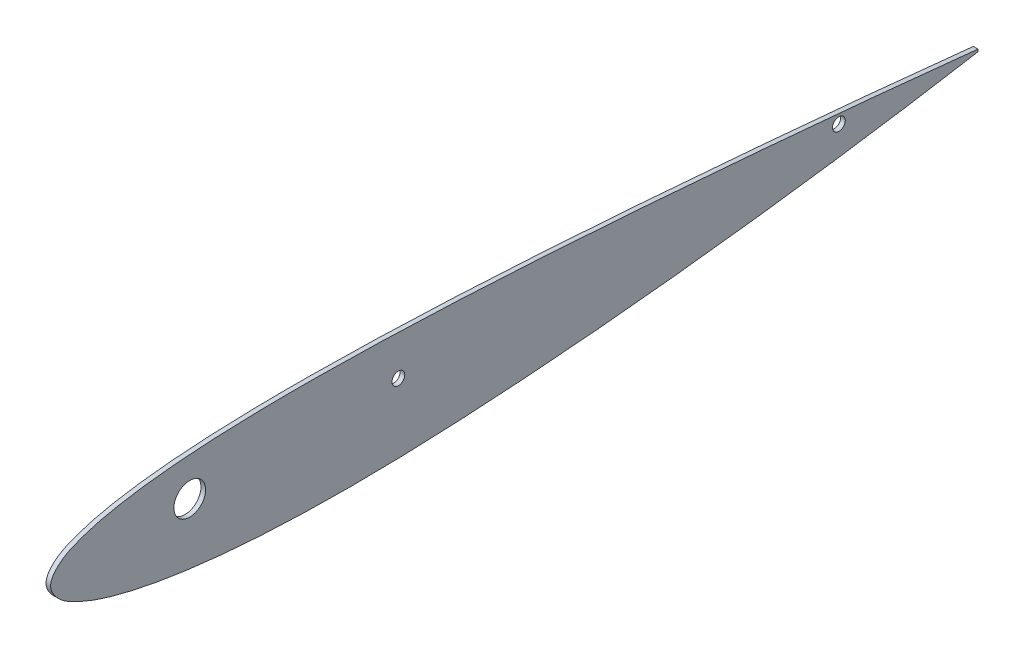
ISO-10303-21;
HEADER;
FILE_DESCRIPTION(('STEP AP214'),'2;1');
FILE_NAME('part.step','',(''),(''),'','','');
FILE_SCHEMA(('AUTOMOTIVE_DESIGN { 1 0 10303 214 1 1 1 1 }'));
ENDSEC;
DATA;
#1=APPLICATION_CONTEXT('core data for automotive mechanical design processes');
#2=APPLICATION_PROTOCOL_DEFINITION('international standard','automotive_design',2000,#1);
#3=PRODUCT_CONTEXT('',#1,'mechanical');
#4=PRODUCT('Part','Part','',(#3));
#5=PRODUCT_RELATED_PRODUCT_CATEGORY('part','',(#4));
#6=PRODUCT_DEFINITION_FORMATION('','',#4);
#7=PRODUCT_DEFINITION_CONTEXT('part definition',#1,'design');
#8=PRODUCT_DEFINITION('design','',#6,#7);
#9=PRODUCT_DEFINITION_SHAPE('','',#8);
#10=(LENGTH_UNIT() NAMED_UNIT(*) SI_UNIT(.MILLI.,.METRE.));
#11=(NAMED_UNIT(*) PLANE_ANGLE_UNIT() SI_UNIT($,.RADIAN.));
#12=(NAMED_UNIT(*) SI_UNIT($,.STERADIAN.) SOLID_ANGLE_UNIT());
#13=UNCERTAINTY_MEASURE_WITH_UNIT(LENGTH_MEASURE(1.E-05),#10,'distance_accuracy_value','');
#14=(GEOMETRIC_REPRESENTATION_CONTEXT(3) GLOBAL_UNCERTAINTY_ASSIGNED_CONTEXT((#13)) GLOBAL_UNIT_ASSIGNED_CONTEXT((#10,
#11,#12)) REPRESENTATION_CONTEXT('',''));
#15=CARTESIAN_POINT('',(0.,0.,0.));
#16=DIRECTION('',(0.,0.,1.));
#17=DIRECTION('',(1.,0.,0.));
#18=AXIS2_PLACEMENT_3D('',#15,#16,#17);
#19=CARTESIAN_POINT('',(2.,0.503992174042304,-400.000313171614));
#20=CARTESIAN_POINT('',(2.,1.20827340100886,-393.301544953931));
#21=CARTESIAN_POINT('',(2.,2.61509826056135,-379.920535640924));
#22=CARTESIAN_POINT('',(2.,5.26204092908528,-353.182419920954));
#23=CARTESIAN_POINT('',(2.,8.36048497007254,-319.807747147461));
#24=CARTESIAN_POINT('',(2.,11.7769418106569,-279.795689887196));
#25=CARTESIAN_POINT('',(2.,14.8714349090721,-239.83985117999));
#26=CARTESIAN_POINT('',(2.,17.5162944706218,-199.92592897574));
#27=CARTESIAN_POINT('',(2.,19.4977105026132,-160.093873002914));
#28=CARTESIAN_POINT('',(2.,20.4474276713772,-126.937018205107));
#29=CARTESIAN_POINT('',(2.,20.583142651895,-100.454521437832));
#30=CARTESIAN_POINT('',(2.,20.244422573222,-80.5683851009151));
#31=CARTESIAN_POINT('',(2.,19.2859043746572,-60.6319168965701));
#32=CARTESIAN_POINT('',(2.,17.7491591057004,-43.9855394702566));
#33=CARTESIAN_POINT('',(2.,15.7357427223296,-30.6260870670138));
#34=CARTESIAN_POINT('',(2.,13.6600237212905,-20.4971255760462));
#35=CARTESIAN_POINT('',(2.,10.940166720717,-11.8821326359626));
#36=CARTESIAN_POINT('',(2.,7.47483493208009,-4.38492530782633));
#37=CARTESIAN_POINT('',(2.,0.371292257930978,2.44601692576104));
#38=CARTESIAN_POINT('',(2.,-7.40123528082568,-3.65032236212266));
#39=CARTESIAN_POINT('',(2.,-11.5552530344191,-10.8325552843253));
#40=CARTESIAN_POINT('',(2.,-15.0619479719034,-19.2304132571483));
#41=CARTESIAN_POINT('',(2.,-18.0006234573957,-29.2385612271778));
#42=CARTESIAN_POINT('',(2.,-21.0820421812687,-42.5473689613135));
#43=CARTESIAN_POINT('',(2.,-23.769599097026,-59.2658971689619));
#44=CARTESIAN_POINT('',(2.,-25.8915490900184,-79.3907562963511));
#45=CARTESIAN_POINT('',(2.,-27.1185073486625,-99.5342061357415));
#46=CARTESIAN_POINT('',(2.,-27.8742360043675,-126.401333061515));
#47=CARTESIAN_POINT('',(2.,-27.3203250964933,-159.954759758316));
#48=CARTESIAN_POINT('',(2.,-25.118222975405,-200.131199498338));
#49=CARTESIAN_POINT('',(2.,-21.8612515921795,-240.218827833143));
#50=CARTESIAN_POINT('',(2.,-17.7008263072649,-280.261192131311));
#51=CARTESIAN_POINT('',(2.,-12.7868544707698,-320.255557769241));
#52=CARTESIAN_POINT('',(2.,-8.05648261964678,-353.526390030437));
#53=CARTESIAN_POINT('',(2.,-3.89731009838293,-380.103644239369));
#54=CARTESIAN_POINT('',(2.,-1.63499916551679,-393.368253000911));
#55=CARTESIAN_POINT('',(2.,-0.503992174042304,-399.999686828386));
#56=B_SPLINE_CURVE_WITH_KNOTS('',3,(#19,#20,#21,#22,#23,#24,#25,#26,#27,#28,#29,#30,#31,#32,#33,
#34,#35,#36,#37,#38,#39,#40,#41,#42,#43,#44,#45,#46,#47,#48,#49,#50,#51,#52,#53,#54,#55),
.UNSPECIFIED.,.F.,.F.,(4,1,1,1,1,1,1,1,1,1,1,1,1,1,1,1,1,1,1,1,1,1,1,1,1,1,1,1,1,1,1,1,1,1,4),
(0.,0.0247898444409783,0.049518527668585,0.0988869468263506,0.148148302407342,0.19731261260843,
0.246378146970664,0.295363956929404,0.34408374332352,0.368442721404916,0.392825641810401,
0.41727490319434,0.441884458853984,0.454325923101425,0.466947515660677,0.480022900195665,
0.487092053261674,0.498227884101779,0.509373674616872,0.516476673346114,0.529639133387933,
0.542377969647895,0.5549439711343,0.579861194114865,0.604653843655577,0.629394084082987,
0.654115914552988,0.703559499032186,0.752843021958462,0.802183907321177,0.851568359011207,
0.900997535580195,0.950476794201679,0.975241647297708,1.),.UNSPECIFIED.);
#57=DIRECTION('',(-1.,0.,0.));
#58=VECTOR('',#57,1.);
#59=SURFACE_OF_LINEAR_EXTRUSION('',#56,#58);
#60=CARTESIAN_POINT('',(0.,0.503992174042304,-400.000313171614));
#61=CARTESIAN_POINT('',(0.,1.20827340100886,-393.301544953931));
#62=CARTESIAN_POINT('',(0.,2.61509826056135,-379.920535640924));
#63=CARTESIAN_POINT('',(0.,5.26204092908528,-353.182419920954));
#64=CARTESIAN_POINT('',(0.,8.36048497007254,-319.807747147461));
#65=CARTESIAN_POINT('',(0.,11.7769418106569,-279.795689887196));
#66=CARTESIAN_POINT('',(0.,14.8714349090721,-239.83985117999));
#67=CARTESIAN_POINT('',(0.,17.5162944706218,-199.92592897574));
#68=CARTESIAN_POINT('',(0.,19.4977105026132,-160.093873002914));
#69=CARTESIAN_POINT('',(0.,20.4474276713772,-126.937018205107));
#70=CARTESIAN_POINT('',(0.,20.583142651895,-100.454521437832));
#71=CARTESIAN_POINT('',(0.,20.244422573222,-80.5683851009151));
#72=CARTESIAN_POINT('',(0.,19.2859043746572,-60.6319168965701));
#73=CARTESIAN_POINT('',(0.,17.7491591057004,-43.9855394702566));
#74=CARTESIAN_POINT('',(0.,15.7357427223296,-30.6260870670138));
#75=CARTESIAN_POINT('',(0.,13.6600237212905,-20.4971255760462));
#76=CARTESIAN_POINT('',(0.,10.940166720717,-11.8821326359626));
#77=CARTESIAN_POINT('',(0.,7.47483493208009,-4.38492530782633));
#78=CARTESIAN_POINT('',(0.,0.371292257930978,2.44601692576104));
#79=CARTESIAN_POINT('',(0.,-7.40123528082568,-3.65032236212266));
#80=CARTESIAN_POINT('',(0.,-11.5552530344191,-10.8325552843253));
#81=CARTESIAN_POINT('',(0.,-15.0619479719034,-19.2304132571483));
#82=CARTESIAN_POINT('',(0.,-18.0006234573957,-29.2385612271778));
#83=CARTESIAN_POINT('',(0.,-21.0820421812687,-42.5473689613135));
#84=CARTESIAN_POINT('',(0.,-23.769599097026,-59.2658971689619));
#85=CARTESIAN_POINT('',(0.,-25.8915490900184,-79.3907562963511));
#86=CARTESIAN_POINT('',(0.,-27.1185073486625,-99.5342061357415));
#87=CARTESIAN_POINT('',(0.,-27.8742360043675,-126.401333061515));
#88=CARTESIAN_POINT('',(0.,-27.3203250964933,-159.954759758316));
#89=CARTESIAN_POINT('',(0.,-25.118222975405,-200.131199498338));
#90=CARTESIAN_POINT('',(0.,-21.8612515921795,-240.218827833143));
#91=CARTESIAN_POINT('',(0.,-17.7008263072649,-280.261192131311));
#92=CARTESIAN_POINT('',(0.,-12.7868544707698,-320.255557769241));
#93=CARTESIAN_POINT('',(0.,-8.05648261964678,-353.526390030437));
#94=CARTESIAN_POINT('',(0.,-3.89731009838293,-380.103644239369));
#95=CARTESIAN_POINT('',(0.,-1.63499916551679,-393.368253000911));
#96=CARTESIAN_POINT('',(0.,-0.503992174042304,-399.999686828386));
#97=B_SPLINE_CURVE_WITH_KNOTS('',3,(#60,#61,#62,#63,#64,#65,#66,#67,#68,#69,#70,#71,#72,#73,#74,
#75,#76,#77,#78,#79,#80,#81,#82,#83,#84,#85,#86,#87,#88,#89,#90,#91,#92,#93,#94,#95,#96),
.UNSPECIFIED.,.F.,.F.,(4,1,1,1,1,1,1,1,1,1,1,1,1,1,1,1,1,1,1,1,1,1,1,1,1,1,1,1,1,1,1,1,1,1,4),
(0.,0.0247898444409783,0.049518527668585,0.0988869468263506,0.148148302407342,0.19731261260843,
0.246378146970664,0.295363956929404,0.34408374332352,0.368442721404916,0.392825641810401,
0.41727490319434,0.441884458853984,0.454325923101425,0.466947515660677,0.480022900195665,
0.487092053261674,0.498227884101779,0.509373674616872,0.516476673346114,0.529639133387933,
0.542377969647895,0.5549439711343,0.579861194114865,0.604653843655577,0.629394084082987,
0.654115914552988,0.703559499032186,0.752843021958462,0.802183907321177,0.851568359011207,
0.900997535580195,0.950476794201679,0.975241647297708,1.),.UNSPECIFIED.);
#98=CARTESIAN_POINT('',(0.,0.503992174042304,-400.000313171614));
#99=VERTEX_POINT('',#98);
#100=CARTESIAN_POINT('',(0.,-0.503992174042304,-399.999686828386));
#101=VERTEX_POINT('',#100);
#102=EDGE_CURVE('E69',#99,#101,#97,.T.);
#103=ORIENTED_EDGE('',*,*,#102,.T.);
#104=DIRECTION('',(-1.,0.,0.));
#105=VECTOR('',#104,1.);
#106=CARTESIAN_POINT('',(2.,-0.503992174042304,-399.999686828386));
#107=LINE('',#106,#105);
#108=CARTESIAN_POINT('',(2.,-0.503992174042304,-399.999686828386));
#109=VERTEX_POINT('',#108);
#110=EDGE_CURVE('E11',#109,#101,#107,.T.);
#111=ORIENTED_EDGE('',*,*,#110,.F.);
#112=CARTESIAN_POINT('',(2.,0.503992174042304,-400.000313171614));
#113=VERTEX_POINT('',#112);
#114=EDGE_CURVE('E68',#113,#109,#56,.T.);
#115=ORIENTED_EDGE('',*,*,#114,.F.);
#116=DIRECTION('',(-1.,0.,0.));
#117=VECTOR('',#116,1.);
#118=CARTESIAN_POINT('',(2.,0.503992174042304,-400.000313171614));
#119=LINE('',#118,#117);
#120=EDGE_CURVE('E45',#113,#99,#119,.T.);
#121=ORIENTED_EDGE('',*,*,#120,.T.);
#122=EDGE_LOOP('',(#103,#111,#115,#121));
#123=FACE_BOUND('',#122,.T.);
#124=ADVANCED_FACE('F35',(#123),#59,.F.);
#125=CARTESIAN_POINT('',(2.,0.503992174042304,-400.000313171614));
#126=DIRECTION('',(0.,0.000621381778174796,0.999999806942324));
#127=DIRECTION('',(0.,-0.999999806942324,0.000621381778174796));
#128=AXIS2_PLACEMENT_3D('',#125,#126,#127);
#129=PLANE('',#128);
#130=DIRECTION('',(0.,0.999999806942324,-0.000621381778174796));
#131=VECTOR('',#130,1.);
#132=CARTESIAN_POINT('',(0.,0.503992174042304,-400.000313171614));
#133=LINE('',#132,#131);
#134=EDGE_CURVE('E61',#101,#99,#133,.T.);
#135=ORIENTED_EDGE('',*,*,#134,.T.);
#136=ORIENTED_EDGE('',*,*,#120,.F.);
#137=DIRECTION('',(0.,0.999999806942324,-0.000621381778174796));
#138=VECTOR('',#137,1.);
#139=CARTESIAN_POINT('',(2.,0.503992174042304,-400.000313171614));
#140=LINE('',#139,#138);
#141=EDGE_CURVE('E53',#109,#113,#140,.T.);
#142=ORIENTED_EDGE('',*,*,#141,.F.);
#143=ORIENTED_EDGE('',*,*,#110,.T.);
#144=EDGE_LOOP('',(#135,#136,#142,#143));
#145=FACE_BOUND('',#144,.T.);
#146=ADVANCED_FACE('F64',(#145),#129,.F.);
#147=CARTESIAN_POINT('',(2.,-1.10326105431103,-0.115364929544274));
#148=DIRECTION('',(1.,0.,0.));
#149=DIRECTION('',(0.,0.,-1.));
#150=AXIS2_PLACEMENT_3D('',#147,#148,#149);
#151=PLANE('',#150);
#152=CARTESIAN_POINT('',(2.,2.5000018824215,-60.));
#153=DIRECTION('',(1.,0.,0.));
#154=DIRECTION('',(0.,0.,-1.));
#155=AXIS2_PLACEMENT_3D('',#152,#153,#154);
#156=CIRCLE('',#155,6.83635541999999);
#157=CARTESIAN_POINT('',(2.,2.5000018824215,-66.83635542));
#158=VERTEX_POINT('',#157);
#159=EDGE_CURVE('E86',#158,#158,#156,.T.);
#160=ORIENTED_EDGE('',*,*,#159,.F.);
#161=EDGE_LOOP('',(#160));
#162=FACE_BOUND('',#161,.T.);
#163=CARTESIAN_POINT('',(2.,2.5000018824215,-150.));
#164=DIRECTION('',(1.,0.,0.));
#165=DIRECTION('',(0.,0.,-1.));
#166=AXIS2_PLACEMENT_3D('',#163,#164,#165);
#167=CIRCLE('',#166,2.75000000000001);
#168=CARTESIAN_POINT('',(2.,2.5000018824215,-152.75));
#169=VERTEX_POINT('',#168);
#170=EDGE_CURVE('E163',#169,#169,#167,.T.);
#171=ORIENTED_EDGE('',*,*,#170,.F.);
#172=EDGE_LOOP('',(#171));
#173=FACE_BOUND('',#172,.T.);
#174=CARTESIAN_POINT('',(2.,2.50000188242148,-340.001541872452));
#175=DIRECTION('',(1.,0.,0.));
#176=DIRECTION('',(0.,0.,-1.));
#177=AXIS2_PLACEMENT_3D('',#174,#175,#176);
#178=CIRCLE('',#177,2.75000000000004);
#179=CARTESIAN_POINT('',(2.,2.50000188242148,-342.751541872452));
#180=VERTEX_POINT('',#179);
#181=EDGE_CURVE('E166',#180,#180,#178,.T.);
#182=ORIENTED_EDGE('',*,*,#181,.F.);
#183=EDGE_LOOP('',(#182));
#184=FACE_BOUND('',#183,.T.);
#185=ORIENTED_EDGE('',*,*,#114,.T.);
#186=ORIENTED_EDGE('',*,*,#141,.T.);
#187=EDGE_LOOP('',(#185,#186));
#188=FACE_BOUND('',#187,.T.);
#189=ADVANCED_FACE('F111',(#162,#173,#184,#188),#151,.T.);
#190=CARTESIAN_POINT('',(0.,-1.10326105431103,-0.115364929544274));
#191=DIRECTION('',(1.,0.,0.));
#192=DIRECTION('',(0.,0.,-1.));
#193=AXIS2_PLACEMENT_3D('',#190,#191,#192);
#194=PLANE('',#193);
#195=CARTESIAN_POINT('',(0.,2.5000018824215,-60.));
#196=DIRECTION('',(1.,0.,0.));
#197=DIRECTION('',(0.,0.,-1.));
#198=AXIS2_PLACEMENT_3D('',#195,#196,#197);
#199=CIRCLE('',#198,6.83635541999999);
#200=CARTESIAN_POINT('',(0.,2.5000018824215,-66.83635542));
#201=VERTEX_POINT('',#200);
#202=EDGE_CURVE('E39',#201,#201,#199,.T.);
#203=ORIENTED_EDGE('',*,*,#202,.T.);
#204=EDGE_LOOP('',(#203));
#205=FACE_BOUND('',#204,.T.);
#206=CARTESIAN_POINT('',(0.,2.5000018824215,-150.));
#207=DIRECTION('',(1.,0.,0.));
#208=DIRECTION('',(0.,0.,-1.));
#209=AXIS2_PLACEMENT_3D('',#206,#207,#208);
#210=CIRCLE('',#209,2.75000000000001);
#211=CARTESIAN_POINT('',(0.,2.5000018824215,-152.75));
#212=VERTEX_POINT('',#211);
#213=EDGE_CURVE('E76',#212,#212,#210,.T.);
#214=ORIENTED_EDGE('',*,*,#213,.T.);
#215=EDGE_LOOP('',(#214));
#216=FACE_BOUND('',#215,.T.);
#217=CARTESIAN_POINT('',(0.,2.50000188242148,-340.001541872452));
#218=DIRECTION('',(1.,0.,0.));
#219=DIRECTION('',(0.,0.,-1.));
#220=AXIS2_PLACEMENT_3D('',#217,#218,#219);
#221=CIRCLE('',#220,2.75000000000004);
#222=CARTESIAN_POINT('',(0.,2.50000188242148,-342.751541872452));
#223=VERTEX_POINT('',#222);
#224=EDGE_CURVE('E84',#223,#223,#221,.T.);
#225=ORIENTED_EDGE('',*,*,#224,.T.);
#226=EDGE_LOOP('',(#225));
#227=FACE_BOUND('',#226,.T.);
#228=ORIENTED_EDGE('',*,*,#102,.F.);
#229=ORIENTED_EDGE('',*,*,#134,.F.);
#230=EDGE_LOOP('',(#228,#229));
#231=FACE_BOUND('',#230,.T.);
#232=ADVANCED_FACE('F73',(#205,#216,#227,#231),#194,.F.);
#233=CARTESIAN_POINT('',(-1.2E-05,2.50000188242148,-340.001541872452));
#234=DIRECTION('',(1.,0.,0.));
#235=DIRECTION('',(0.,0.,-1.));
#236=AXIS2_PLACEMENT_3D('',#233,#234,#235);
#237=CYLINDRICAL_SURFACE('',#236,2.75000000000004);
#238=ORIENTED_EDGE('',*,*,#181,.T.);
#239=EDGE_LOOP('',(#238));
#240=FACE_BOUND('',#239,.T.);
#241=ORIENTED_EDGE('',*,*,#224,.F.);
#242=EDGE_LOOP('',(#241));
#243=FACE_BOUND('',#242,.T.);
#244=ADVANCED_FACE('F95',(#240,#243),#237,.F.);
#245=CARTESIAN_POINT('',(-1.2E-05,2.5000018824215,-150.));
#246=DIRECTION('',(1.,0.,0.));
#247=DIRECTION('',(0.,0.,-1.));
#248=AXIS2_PLACEMENT_3D('',#245,#246,#247);
#249=CYLINDRICAL_SURFACE('',#248,2.75000000000001);
#250=ORIENTED_EDGE('',*,*,#170,.T.);
#251=EDGE_LOOP('',(#250));
#252=FACE_BOUND('',#251,.T.);
#253=ORIENTED_EDGE('',*,*,#213,.F.);
#254=EDGE_LOOP('',(#253));
#255=FACE_BOUND('',#254,.T.);
#256=ADVANCED_FACE('F92',(#252,#255),#249,.F.);
#257=CARTESIAN_POINT('',(-1.2E-05,2.5000018824215,-60.));
#258=DIRECTION('',(1.,0.,0.));
#259=DIRECTION('',(0.,0.,-1.));
#260=AXIS2_PLACEMENT_3D('',#257,#258,#259);
#261=CYLINDRICAL_SURFACE('',#260,6.83635541999999);
#262=ORIENTED_EDGE('',*,*,#159,.T.);
#263=EDGE_LOOP('',(#262));
#264=FACE_BOUND('',#263,.T.);
#265=ORIENTED_EDGE('',*,*,#202,.F.);
#266=EDGE_LOOP('',(#265));
#267=FACE_BOUND('',#266,.T.);
#268=ADVANCED_FACE('F94',(#264,#267),#261,.F.);
#269=CLOSED_SHELL('',(#124,#146,#189,#232,#244,#256,#268));
#270=MANIFOLD_SOLID_BREP('B2',#269);
#271=ADVANCED_BREP_SHAPE_REPRESENTATION('',(#18,#270),#14);
#272=SHAPE_DEFINITION_REPRESENTATION(#9,#271);
ENDSEC;
END-ISO-10303-21;
